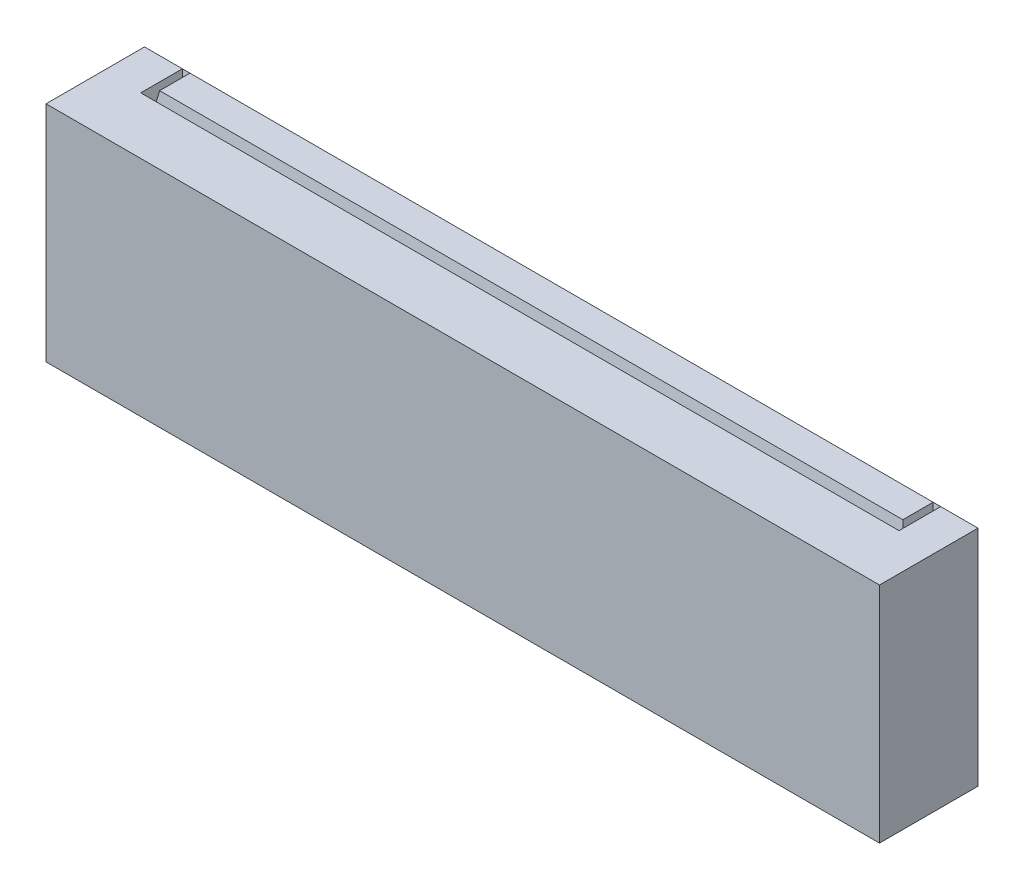
ISO-10303-21;
HEADER;
FILE_DESCRIPTION(('STEP AP214'),'2;1');
FILE_NAME('part.step','',(''),(''),'','','');
FILE_SCHEMA(('AUTOMOTIVE_DESIGN { 1 0 10303 214 1 1 1 1 }'));
ENDSEC;
DATA;
#1=APPLICATION_CONTEXT('core data for automotive mechanical design processes');
#2=APPLICATION_PROTOCOL_DEFINITION('international standard','automotive_design',2000,#1);
#3=PRODUCT_CONTEXT('',#1,'mechanical');
#4=PRODUCT('Part','Part','',(#3));
#5=PRODUCT_RELATED_PRODUCT_CATEGORY('part','',(#4));
#6=PRODUCT_DEFINITION_FORMATION('','',#4);
#7=PRODUCT_DEFINITION_CONTEXT('part definition',#1,'design');
#8=PRODUCT_DEFINITION('design','',#6,#7);
#9=PRODUCT_DEFINITION_SHAPE('','',#8);
#10=(LENGTH_UNIT() NAMED_UNIT(*) SI_UNIT(.MILLI.,.METRE.));
#11=(NAMED_UNIT(*) PLANE_ANGLE_UNIT() SI_UNIT($,.RADIAN.));
#12=(NAMED_UNIT(*) SI_UNIT($,.STERADIAN.) SOLID_ANGLE_UNIT());
#13=UNCERTAINTY_MEASURE_WITH_UNIT(LENGTH_MEASURE(1.E-05),#10,'distance_accuracy_value','');
#14=(GEOMETRIC_REPRESENTATION_CONTEXT(3) GLOBAL_UNCERTAINTY_ASSIGNED_CONTEXT((#13)) GLOBAL_UNIT_ASSIGNED_CONTEXT((#10,
#11,#12)) REPRESENTATION_CONTEXT('',''));
#15=CARTESIAN_POINT('',(0.,0.,0.));
#16=DIRECTION('',(0.,0.,1.));
#17=DIRECTION('',(1.,0.,0.));
#18=AXIS2_PLACEMENT_3D('',#15,#16,#17);
#19=CARTESIAN_POINT('',(0.,5.9,-2.6));
#20=DIRECTION('',(0.,1.,0.));
#21=DIRECTION('',(0.,0.,1.));
#22=AXIS2_PLACEMENT_3D('',#19,#20,#21);
#23=PLANE('',#22);
#24=DIRECTION('',(-1.,0.,0.));
#25=VECTOR('',#24,1.);
#26=CARTESIAN_POINT('',(0.,5.9,-2.6));
#27=LINE('',#26,#25);
#28=CARTESIAN_POINT('',(0.,5.9,-2.6));
#29=VERTEX_POINT('',#28);
#30=CARTESIAN_POINT('',(-0.983855035663145,5.9,-2.6));
#31=VERTEX_POINT('',#30);
#32=EDGE_CURVE('E89',#29,#31,#27,.T.);
#33=ORIENTED_EDGE('',*,*,#32,.T.);
#34=DIRECTION('',(0.,0.,1.));
#35=VECTOR('',#34,1.);
#36=CARTESIAN_POINT('',(-0.983855035663145,5.9,-1.3));
#37=LINE('',#36,#35);
#38=CARTESIAN_POINT('',(-0.983855035663145,5.9,-1.5));
#39=VERTEX_POINT('',#38);
#40=EDGE_CURVE('E52',#31,#39,#37,.T.);
#41=ORIENTED_EDGE('',*,*,#40,.T.);
#42=DIRECTION('',(1.,0.,0.));
#43=VECTOR('',#42,1.);
#44=CARTESIAN_POINT('',(-28.3724921296977,5.9,-1.5));
#45=LINE('',#44,#43);
#46=CARTESIAN_POINT('',(-21.,5.9,-1.5));
#47=VERTEX_POINT('',#46);
#48=EDGE_CURVE('E249',#47,#39,#45,.T.);
#49=ORIENTED_EDGE('',*,*,#48,.F.);
#50=DIRECTION('',(0.,0.,1.));
#51=VECTOR('',#50,1.);
#52=CARTESIAN_POINT('',(-21.,5.9,-1.3));
#53=LINE('',#52,#51);
#54=CARTESIAN_POINT('',(-21.,5.9,-2.6));
#55=VERTEX_POINT('',#54);
#56=EDGE_CURVE('E275',#55,#47,#53,.T.);
#57=ORIENTED_EDGE('',*,*,#56,.F.);
#58=CARTESIAN_POINT('',(-22.,5.9,-2.59999999999999));
#59=VERTEX_POINT('',#58);
#60=EDGE_CURVE('E160',#55,#59,#27,.T.);
#61=ORIENTED_EDGE('',*,*,#60,.T.);
#62=DIRECTION('',(0.,0.,1.));
#63=VECTOR('',#62,1.);
#64=CARTESIAN_POINT('',(-22.,5.9,0.));
#65=LINE('',#64,#63);
#66=CARTESIAN_POINT('',(-22.,5.9,0.));
#67=VERTEX_POINT('',#66);
#68=EDGE_CURVE('E162',#59,#67,#65,.T.);
#69=ORIENTED_EDGE('',*,*,#68,.T.);
#70=DIRECTION('',(1.,0.,0.));
#71=VECTOR('',#70,1.);
#72=CARTESIAN_POINT('',(0.,5.9,0.));
#73=LINE('',#72,#71);
#74=CARTESIAN_POINT('',(0.,5.9,0.));
#75=VERTEX_POINT('',#74);
#76=EDGE_CURVE('E61',#67,#75,#73,.T.);
#77=ORIENTED_EDGE('',*,*,#76,.T.);
#78=DIRECTION('',(0.,0.,-1.));
#79=VECTOR('',#78,1.);
#80=CARTESIAN_POINT('',(0.,5.9,0.));
#81=LINE('',#80,#79);
#82=EDGE_CURVE('E163',#75,#29,#81,.T.);
#83=ORIENTED_EDGE('',*,*,#82,.T.);
#84=EDGE_LOOP('',(#33,#41,#49,#57,#61,#69,#77,#83));
#85=FACE_BOUND('',#84,.T.);
#86=ADVANCED_FACE('F37',(#85),#23,.T.);
#87=CARTESIAN_POINT('',(-1.18385503566314,5.9,-2.6));
#88=VERTEX_POINT('',#87);
#89=CARTESIAN_POINT('',(-20.8,5.9,-2.6));
#90=VERTEX_POINT('',#89);
#91=EDGE_CURVE('E151',#88,#90,#27,.T.);
#92=ORIENTED_EDGE('',*,*,#91,.T.);
#93=DIRECTION('',(0.,0.,1.));
#94=VECTOR('',#93,1.);
#95=CARTESIAN_POINT('',(-20.8,5.9,-1.3));
#96=LINE('',#95,#94);
#97=CARTESIAN_POINT('',(-20.8,5.9,-1.8));
#98=VERTEX_POINT('',#97);
#99=EDGE_CURVE('E272',#90,#98,#96,.T.);
#100=ORIENTED_EDGE('',*,*,#99,.T.);
#101=DIRECTION('',(1.,0.,0.));
#102=VECTOR('',#101,1.);
#103=CARTESIAN_POINT('',(-28.3724921296977,5.9,-1.8));
#104=LINE('',#103,#102);
#105=CARTESIAN_POINT('',(-1.18385503566314,5.9,-1.8));
#106=VERTEX_POINT('',#105);
#107=EDGE_CURVE('E153',#98,#106,#104,.T.);
#108=ORIENTED_EDGE('',*,*,#107,.T.);
#109=DIRECTION('',(0.,0.,1.));
#110=VECTOR('',#109,1.);
#111=CARTESIAN_POINT('',(-1.18385503566314,5.9,-1.3));
#112=LINE('',#111,#110);
#113=EDGE_CURVE('E136',#88,#106,#112,.T.);
#114=ORIENTED_EDGE('',*,*,#113,.F.);
#115=EDGE_LOOP('',(#92,#100,#108,#114));
#116=FACE_BOUND('',#115,.T.);
#117=ADVANCED_FACE('F149',(#116),#23,.T.);
#118=CARTESIAN_POINT('',(0.,5.9,0.));
#119=DIRECTION('',(-1.,0.,0.));
#120=DIRECTION('',(0.,0.,1.));
#121=AXIS2_PLACEMENT_3D('',#118,#119,#120);
#122=PLANE('',#121);
#123=DIRECTION('',(0.,0.,-1.));
#124=VECTOR('',#123,1.);
#125=CARTESIAN_POINT('',(0.,0.,0.));
#126=LINE('',#125,#124);
#127=CARTESIAN_POINT('',(0.,0.,0.));
#128=VERTEX_POINT('',#127);
#129=CARTESIAN_POINT('',(0.,0.,-2.6));
#130=VERTEX_POINT('',#129);
#131=EDGE_CURVE('E170',#128,#130,#126,.T.);
#132=ORIENTED_EDGE('',*,*,#131,.T.);
#133=DIRECTION('',(0.,-1.,0.));
#134=VECTOR('',#133,1.);
#135=CARTESIAN_POINT('',(0.,5.9,-2.6));
#136=LINE('',#135,#134);
#137=EDGE_CURVE('E11',#29,#130,#136,.T.);
#138=ORIENTED_EDGE('',*,*,#137,.F.);
#139=ORIENTED_EDGE('',*,*,#82,.F.);
#140=DIRECTION('',(0.,-1.,0.));
#141=VECTOR('',#140,1.);
#142=CARTESIAN_POINT('',(0.,5.9,0.));
#143=LINE('',#142,#141);
#144=EDGE_CURVE('E169',#75,#128,#143,.T.);
#145=ORIENTED_EDGE('',*,*,#144,.T.);
#146=EDGE_LOOP('',(#132,#138,#139,#145));
#147=FACE_BOUND('',#146,.T.);
#148=ADVANCED_FACE('F39',(#147),#122,.F.);
#149=CARTESIAN_POINT('',(0.,5.9,-2.6));
#150=DIRECTION('',(0.,0.,1.));
#151=DIRECTION('',(1.,0.,0.));
#152=AXIS2_PLACEMENT_3D('',#149,#150,#151);
#153=PLANE('',#152);
#154=DIRECTION('',(-1.,0.,0.));
#155=VECTOR('',#154,1.);
#156=CARTESIAN_POINT('',(0.,0.,-2.6));
#157=LINE('',#156,#155);
#158=CARTESIAN_POINT('',(-22.,0.,-2.59999999999999));
#159=VERTEX_POINT('',#158);
#160=EDGE_CURVE('E173',#130,#159,#157,.T.);
#161=ORIENTED_EDGE('',*,*,#160,.T.);
#162=DIRECTION('',(0.,-1.,0.));
#163=VECTOR('',#162,1.);
#164=CARTESIAN_POINT('',(-22.,5.9,-2.59999999999999));
#165=LINE('',#164,#163);
#166=EDGE_CURVE('E45',#59,#159,#165,.T.);
#167=ORIENTED_EDGE('',*,*,#166,.F.);
#168=ORIENTED_EDGE('',*,*,#60,.F.);
#169=DIRECTION('',(-1.,0.,0.));
#170=VECTOR('',#169,1.);
#171=CARTESIAN_POINT('',(-28.3724921296977,5.9,-2.59999999999999));
#172=LINE('',#171,#170);
#173=EDGE_CURVE('E159',#90,#55,#172,.T.);
#174=ORIENTED_EDGE('',*,*,#173,.F.);
#175=ORIENTED_EDGE('',*,*,#91,.F.);
#176=DIRECTION('',(-1.,0.,0.));
#177=VECTOR('',#176,1.);
#178=CARTESIAN_POINT('',(-28.3724921296977,5.9,-2.59999999999999));
#179=LINE('',#178,#177);
#180=EDGE_CURVE('E143',#31,#88,#179,.T.);
#181=ORIENTED_EDGE('',*,*,#180,.F.);
#182=ORIENTED_EDGE('',*,*,#32,.F.);
#183=ORIENTED_EDGE('',*,*,#137,.T.);
#184=EDGE_LOOP('',(#161,#167,#168,#174,#175,#181,#182,#183));
#185=FACE_BOUND('',#184,.T.);
#186=ADVANCED_FACE('F156',(#185),#153,.F.);
#187=CARTESIAN_POINT('',(-22.,5.9,0.));
#188=DIRECTION('',(1.,0.,0.));
#189=DIRECTION('',(0.,0.,-1.));
#190=AXIS2_PLACEMENT_3D('',#187,#188,#189);
#191=PLANE('',#190);
#192=DIRECTION('',(0.,0.,1.));
#193=VECTOR('',#192,1.);
#194=CARTESIAN_POINT('',(-22.,0.,0.));
#195=LINE('',#194,#193);
#196=CARTESIAN_POINT('',(-22.,0.,0.));
#197=VERTEX_POINT('',#196);
#198=EDGE_CURVE('E176',#159,#197,#195,.T.);
#199=ORIENTED_EDGE('',*,*,#198,.T.);
#200=DIRECTION('',(0.,-1.,0.));
#201=VECTOR('',#200,1.);
#202=CARTESIAN_POINT('',(-22.,5.9,0.));
#203=LINE('',#202,#201);
#204=EDGE_CURVE('E180',#67,#197,#203,.T.);
#205=ORIENTED_EDGE('',*,*,#204,.F.);
#206=ORIENTED_EDGE('',*,*,#68,.F.);
#207=ORIENTED_EDGE('',*,*,#166,.T.);
#208=EDGE_LOOP('',(#199,#205,#206,#207));
#209=FACE_BOUND('',#208,.T.);
#210=ADVANCED_FACE('F186',(#209),#191,.F.);
#211=CARTESIAN_POINT('',(0.,5.9,0.));
#212=DIRECTION('',(0.,0.,-1.));
#213=DIRECTION('',(-1.,0.,0.));
#214=AXIS2_PLACEMENT_3D('',#211,#212,#213);
#215=PLANE('',#214);
#216=DIRECTION('',(1.,0.,0.));
#217=VECTOR('',#216,1.);
#218=CARTESIAN_POINT('',(0.,0.,0.));
#219=LINE('',#218,#217);
#220=EDGE_CURVE('E82',#197,#128,#219,.T.);
#221=ORIENTED_EDGE('',*,*,#220,.T.);
#222=ORIENTED_EDGE('',*,*,#144,.F.);
#223=ORIENTED_EDGE('',*,*,#76,.F.);
#224=ORIENTED_EDGE('',*,*,#204,.T.);
#225=EDGE_LOOP('',(#221,#222,#223,#224));
#226=FACE_BOUND('',#225,.T.);
#227=ADVANCED_FACE('F194',(#226),#215,.F.);
#228=CARTESIAN_POINT('',(0.,0.,-2.6));
#229=DIRECTION('',(0.,1.,0.));
#230=DIRECTION('',(0.,0.,1.));
#231=AXIS2_PLACEMENT_3D('',#228,#229,#230);
#232=PLANE('',#231);
#233=ORIENTED_EDGE('',*,*,#131,.F.);
#234=ORIENTED_EDGE('',*,*,#220,.F.);
#235=ORIENTED_EDGE('',*,*,#198,.F.);
#236=ORIENTED_EDGE('',*,*,#160,.F.);
#237=EDGE_LOOP('',(#233,#234,#235,#236));
#238=FACE_BOUND('',#237,.T.);
#239=ADVANCED_FACE('F190',(#238),#232,.F.);
#240=CARTESIAN_POINT('',(-0.983855035663145,5.9,-1.3));
#241=DIRECTION('',(0.984807753012208,-0.173648177666931,0.));
#242=DIRECTION('',(0.173648177666931,0.984807753012208,0.));
#243=AXIS2_PLACEMENT_3D('',#240,#241,#242);
#244=PLANE('',#243);
#245=DIRECTION('',(-0.171087869746036,-0.970287525247814,0.171087869746036));
#246=VECTOR('',#245,1.);
#247=CARTESIAN_POINT('',(-1.78554945274432,1.35336502751853,-0.998305582918824));
#248=LINE('',#247,#246);
#249=CARTESIAN_POINT('',(-1.08385503566314,5.33287181803823,-1.7));
#250=VERTEX_POINT('',#249);
#251=CARTESIAN_POINT('',(-1.13385503566315,5.04930772705735,-1.65));
#252=VERTEX_POINT('',#251);
#253=EDGE_CURVE('E238',#250,#252,#248,.T.);
#254=ORIENTED_EDGE('',*,*,#253,.T.);
#255=DIRECTION('',(-0.171087869746036,-0.970287525247814,-0.171087869746036));
#256=VECTOR('',#255,1.);
#257=CARTESIAN_POINT('',(-0.978000823828297,5.93320088514716,-1.49414578816515));
#258=LINE('',#257,#256);
#259=EDGE_CURVE('E241',#252,#39,#258,.F.);
#260=ORIENTED_EDGE('',*,*,#259,.T.);
#261=ORIENTED_EDGE('',*,*,#40,.F.);
#262=DIRECTION('',(-0.171087869746036,-0.970287525247814,0.171087869746036));
#263=VECTOR('',#262,1.);
#264=CARTESIAN_POINT('',(-1.78554945274432,1.35336502751853,-1.79830558291882));
#265=LINE('',#264,#263);
#266=CARTESIAN_POINT('',(-1.08385503566314,5.33287181803827,-2.5));
#267=VERTEX_POINT('',#266);
#268=EDGE_CURVE('E141',#267,#31,#265,.F.);
#269=ORIENTED_EDGE('',*,*,#268,.F.);
#270=DIRECTION('',(0.,0.,1.));
#271=VECTOR('',#270,1.);
#272=CARTESIAN_POINT('',(-1.08385503566314,5.33287181803823,-1.3));
#273=LINE('',#272,#271);
#274=EDGE_CURVE('E138',#250,#267,#273,.F.);
#275=ORIENTED_EDGE('',*,*,#274,.F.);
#276=EDGE_LOOP('',(#254,#260,#261,#269,#275));
#277=FACE_BOUND('',#276,.T.);
#278=ADVANCED_FACE('F201',(#277),#244,.F.);
#279=CARTESIAN_POINT('',(-28.3724921296977,5.9,-1.5));
#280=DIRECTION('',(0.,-0.173648177666931,0.984807753012208));
#281=DIRECTION('',(0.,-0.984807753012208,-0.173648177666931));
#282=AXIS2_PLACEMENT_3D('',#279,#280,#281);
#283=PLANE('',#282);
#284=DIRECTION('',(-0.171087869746036,0.970287525247814,0.171087869746036));
#285=VECTOR('',#284,1.);
#286=CARTESIAN_POINT('',(-21.0058542118348,5.93320088514716,-1.49414578816515));
#287=LINE('',#286,#285);
#288=CARTESIAN_POINT('',(-20.85,5.04930772705735,-1.65));
#289=VERTEX_POINT('',#288);
#290=EDGE_CURVE('E251',#289,#47,#287,.T.);
#291=ORIENTED_EDGE('',*,*,#290,.T.);
#292=ORIENTED_EDGE('',*,*,#48,.T.);
#293=ORIENTED_EDGE('',*,*,#259,.F.);
#294=DIRECTION('',(-1.,0.,0.));
#295=VECTOR('',#294,1.);
#296=CARTESIAN_POINT('',(-28.3724921296977,5.04930772705735,-1.65));
#297=LINE('',#296,#295);
#298=EDGE_CURVE('E174',#289,#252,#297,.F.);
#299=ORIENTED_EDGE('',*,*,#298,.F.);
#300=EDGE_LOOP('',(#291,#292,#293,#299));
#301=FACE_BOUND('',#300,.T.);
#302=ADVANCED_FACE('F210',(#301),#283,.F.);
#303=CARTESIAN_POINT('',(-21.,5.9,-1.3));
#304=DIRECTION('',(-0.984807753012208,-0.173648177666931,0.));
#305=DIRECTION('',(0.173648177666931,-0.984807753012208,0.));
#306=AXIS2_PLACEMENT_3D('',#303,#304,#305);
#307=PLANE('',#306);
#308=DIRECTION('',(0.171087869746036,-0.970287525247814,0.171087869746036));
#309=VECTOR('',#308,1.);
#310=CARTESIAN_POINT('',(-20.9853644704129,5.8169977871321,-1.78536447041288));
#311=LINE('',#310,#309);
#312=CARTESIAN_POINT('',(-20.9,5.33287181803823,-1.7));
#313=VERTEX_POINT('',#312);
#314=EDGE_CURVE('E243',#289,#313,#311,.F.);
#315=ORIENTED_EDGE('',*,*,#314,.T.);
#316=DIRECTION('',(0.,0.,1.));
#317=VECTOR('',#316,1.);
#318=CARTESIAN_POINT('',(-20.9,5.33287181803823,-1.3));
#319=LINE('',#318,#317);
#320=CARTESIAN_POINT('',(-20.9,5.33287181803823,-2.5));
#321=VERTEX_POINT('',#320);
#322=EDGE_CURVE('E250',#313,#321,#319,.F.);
#323=ORIENTED_EDGE('',*,*,#322,.T.);
#324=DIRECTION('',(-0.171087869746036,0.970287525247814,-0.171087869746036));
#325=VECTOR('',#324,1.);
#326=CARTESIAN_POINT('',(-21.21580065339,7.12386632223218,-2.81580065338997));
#327=LINE('',#326,#325);
#328=EDGE_CURVE('E254',#321,#55,#327,.T.);
#329=ORIENTED_EDGE('',*,*,#328,.T.);
#330=ORIENTED_EDGE('',*,*,#56,.T.);
#331=ORIENTED_EDGE('',*,*,#290,.F.);
#332=EDGE_LOOP('',(#315,#323,#329,#330,#331));
#333=FACE_BOUND('',#332,.T.);
#334=ADVANCED_FACE('F213',(#333),#307,.F.);
#335=CARTESIAN_POINT('',(-28.3724921296977,5.9,-2.59999999999999));
#336=DIRECTION('',(0.,-0.173648177666931,-0.984807753012208));
#337=DIRECTION('',(0.,0.984807753012208,-0.173648177666931));
#338=AXIS2_PLACEMENT_3D('',#335,#336,#337);
#339=PLANE('',#338);
#340=ORIENTED_EDGE('',*,*,#173,.T.);
#341=ORIENTED_EDGE('',*,*,#328,.F.);
#342=DIRECTION('',(-0.171087869746036,-0.970287525247814,0.171087869746036));
#343=VECTOR('',#342,1.);
#344=CARTESIAN_POINT('',(-21.0216548652248,4.64293279262066,-2.37834513477517));
#345=LINE('',#344,#343);
#346=EDGE_CURVE('E263',#321,#90,#345,.F.);
#347=ORIENTED_EDGE('',*,*,#346,.T.);
#348=EDGE_LOOP('',(#340,#341,#347));
#349=FACE_BOUND('',#348,.T.);
#350=ADVANCED_FACE('F217',(#349),#339,.F.);
#351=CARTESIAN_POINT('',(-20.8,5.9,-1.3));
#352=DIRECTION('',(0.984807753012208,-0.173648177666931,0.));
#353=DIRECTION('',(0.173648177666931,0.984807753012208,0.));
#354=AXIS2_PLACEMENT_3D('',#351,#352,#353);
#355=PLANE('',#354);
#356=DIRECTION('',(0.171087869746036,0.970287525247814,-0.171087869746036));
#357=VECTOR('',#356,1.);
#358=CARTESIAN_POINT('',(-20.8146355295871,5.8169977871321,-1.78536447041288));
#359=LINE('',#358,#357);
#360=EDGE_CURVE('E261',#313,#98,#359,.T.);
#361=ORIENTED_EDGE('',*,*,#360,.T.);
#362=ORIENTED_EDGE('',*,*,#99,.F.);
#363=ORIENTED_EDGE('',*,*,#346,.F.);
#364=ORIENTED_EDGE('',*,*,#322,.F.);
#365=EDGE_LOOP('',(#361,#362,#363,#364));
#366=FACE_BOUND('',#365,.T.);
#367=ADVANCED_FACE('F221',(#366),#355,.F.);
#368=CARTESIAN_POINT('',(-28.3724921296977,5.9,-1.8));
#369=DIRECTION('',(0.,-0.173648177666931,-0.984807753012208));
#370=DIRECTION('',(0.,0.984807753012208,-0.173648177666931));
#371=AXIS2_PLACEMENT_3D('',#368,#369,#370);
#372=PLANE('',#371);
#373=ORIENTED_EDGE('',*,*,#298,.T.);
#374=ORIENTED_EDGE('',*,*,#253,.F.);
#375=DIRECTION('',(0.171087869746036,-0.970287525247814,0.171087869746036));
#376=VECTOR('',#375,1.);
#377=CARTESIAN_POINT('',(-1.16921950607603,5.8169977871321,-1.78536447041288));
#378=LINE('',#377,#376);
#379=EDGE_CURVE('E140',#250,#106,#378,.F.);
#380=ORIENTED_EDGE('',*,*,#379,.T.);
#381=ORIENTED_EDGE('',*,*,#107,.F.);
#382=ORIENTED_EDGE('',*,*,#360,.F.);
#383=ORIENTED_EDGE('',*,*,#314,.F.);
#384=EDGE_LOOP('',(#373,#374,#380,#381,#382,#383));
#385=FACE_BOUND('',#384,.T.);
#386=ADVANCED_FACE('F225',(#385),#372,.F.);
#387=CARTESIAN_POINT('',(-1.18385503566314,5.9,-1.3));
#388=DIRECTION('',(-0.984807753012208,-0.173648177666931,0.));
#389=DIRECTION('',(0.173648177666931,-0.984807753012208,0.));
#390=AXIS2_PLACEMENT_3D('',#387,#388,#389);
#391=PLANE('',#390);
#392=ORIENTED_EDGE('',*,*,#274,.T.);
#393=DIRECTION('',(-0.171087869746036,0.970287525247814,-0.171087869746036));
#394=VECTOR('',#393,1.);
#395=CARTESIAN_POINT('',(-1.97969524090947,10.4134340873343,-3.39584020524633));
#396=LINE('',#395,#394);
#397=EDGE_CURVE('E131',#267,#88,#396,.T.);
#398=ORIENTED_EDGE('',*,*,#397,.T.);
#399=ORIENTED_EDGE('',*,*,#113,.T.);
#400=ORIENTED_EDGE('',*,*,#379,.F.);
#401=EDGE_LOOP('',(#392,#398,#399,#400));
#402=FACE_BOUND('',#401,.T.);
#403=ADVANCED_FACE('F133',(#402),#391,.F.);
#404=CARTESIAN_POINT('',(-28.3724921296977,5.9,-2.59999999999999));
#405=DIRECTION('',(0.,-0.173648177666931,-0.984807753012208));
#406=DIRECTION('',(0.,0.984807753012208,-0.173648177666931));
#407=AXIS2_PLACEMENT_3D('',#404,#405,#406);
#408=PLANE('',#407);
#409=ORIENTED_EDGE('',*,*,#180,.T.);
#410=ORIENTED_EDGE('',*,*,#397,.F.);
#411=ORIENTED_EDGE('',*,*,#268,.T.);
#412=EDGE_LOOP('',(#409,#410,#411));
#413=FACE_BOUND('',#412,.T.);
#414=ADVANCED_FACE('F144',(#413),#408,.F.);
#415=CLOSED_SHELL('',(#86,#117,#148,#186,#210,#227,#239,#278,#302,#334,#350,#367,#386,#403,#414));
#416=MANIFOLD_SOLID_BREP('B2',#415);
#417=ADVANCED_BREP_SHAPE_REPRESENTATION('',(#18,#416),#14);
#418=SHAPE_DEFINITION_REPRESENTATION(#9,#417);
ENDSEC;
END-ISO-10303-21;
